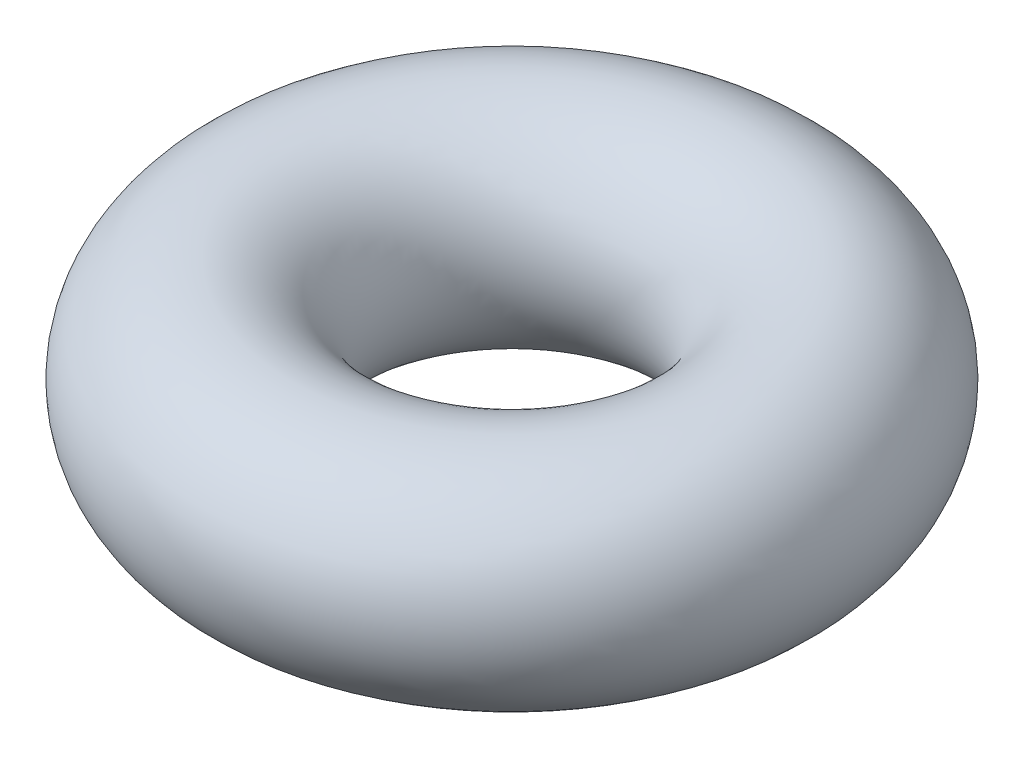
ISO-10303-21;
HEADER;
FILE_DESCRIPTION(('STEP AP214'),'2;1');
FILE_NAME('part.step','',(''),(''),'','','');
FILE_SCHEMA(('AUTOMOTIVE_DESIGN { 1 0 10303 214 1 1 1 1 }'));
ENDSEC;
DATA;
#1=APPLICATION_CONTEXT('core data for automotive mechanical design processes');
#2=APPLICATION_PROTOCOL_DEFINITION('international standard','automotive_design',2000,#1);
#3=PRODUCT_CONTEXT('',#1,'mechanical');
#4=PRODUCT('Part','Part','',(#3));
#5=PRODUCT_RELATED_PRODUCT_CATEGORY('part','',(#4));
#6=PRODUCT_DEFINITION_FORMATION('','',#4);
#7=PRODUCT_DEFINITION_CONTEXT('part definition',#1,'design');
#8=PRODUCT_DEFINITION('design','',#6,#7);
#9=PRODUCT_DEFINITION_SHAPE('','',#8);
#10=(LENGTH_UNIT() NAMED_UNIT(*) SI_UNIT(.MILLI.,.METRE.));
#11=(NAMED_UNIT(*) PLANE_ANGLE_UNIT() SI_UNIT($,.RADIAN.));
#12=(NAMED_UNIT(*) SI_UNIT($,.STERADIAN.) SOLID_ANGLE_UNIT());
#13=UNCERTAINTY_MEASURE_WITH_UNIT(LENGTH_MEASURE(1.E-05),#10,'distance_accuracy_value','');
#14=(GEOMETRIC_REPRESENTATION_CONTEXT(3) GLOBAL_UNCERTAINTY_ASSIGNED_CONTEXT((#13)) GLOBAL_UNIT_ASSIGNED_CONTEXT((#10,
#11,#12)) REPRESENTATION_CONTEXT('',''));
#15=CARTESIAN_POINT('',(0.,0.,0.));
#16=DIRECTION('',(0.,0.,1.));
#17=DIRECTION('',(1.,0.,0.));
#18=AXIS2_PLACEMENT_3D('',#15,#16,#17);
#19=CARTESIAN_POINT('',(0.,0.,0.));
#20=DIRECTION('',(0.,-1.,0.));
#21=DIRECTION('',(0.,0.,-1.));
#22=AXIS2_PLACEMENT_3D('',#19,#20,#21);
#23=TOROIDAL_SURFACE('',#22,1.975,0.95);
#24=CARTESIAN_POINT('',(0.,0.,-2.925));
#25=VERTEX_POINT('',#24);
#26=VERTEX_LOOP('',#25);
#27=FACE_BOUND('',#26,.T.);
#28=ADVANCED_FACE('F39',(#27),#23,.T.);
#29=CLOSED_SHELL('',(#28));
#30=MANIFOLD_SOLID_BREP('B2',#29);
#31=ADVANCED_BREP_SHAPE_REPRESENTATION('',(#18,#30),#14);
#32=SHAPE_DEFINITION_REPRESENTATION(#9,#31);
ENDSEC;
END-ISO-10303-21;
